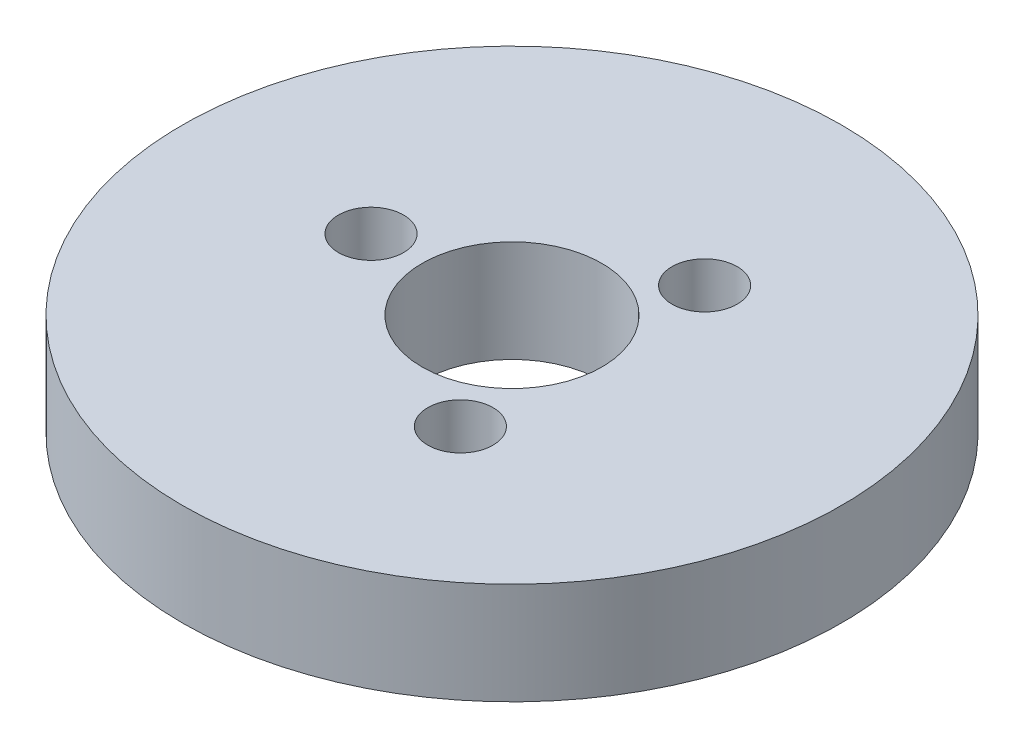
ISO-10303-21;
HEADER;
FILE_DESCRIPTION(('STEP AP214'),'2;1');
FILE_NAME('part.step','',(''),(''),'','','');
FILE_SCHEMA(('AUTOMOTIVE_DESIGN { 1 0 10303 214 1 1 1 1 }'));
ENDSEC;
DATA;
#1=APPLICATION_CONTEXT('core data for automotive mechanical design processes');
#2=APPLICATION_PROTOCOL_DEFINITION('international standard','automotive_design',2000,#1);
#3=PRODUCT_CONTEXT('',#1,'mechanical');
#4=PRODUCT('Part','Part','',(#3));
#5=PRODUCT_RELATED_PRODUCT_CATEGORY('part','',(#4));
#6=PRODUCT_DEFINITION_FORMATION('','',#4);
#7=PRODUCT_DEFINITION_CONTEXT('part definition',#1,'design');
#8=PRODUCT_DEFINITION('design','',#6,#7);
#9=PRODUCT_DEFINITION_SHAPE('','',#8);
#10=(LENGTH_UNIT() NAMED_UNIT(*) SI_UNIT(.MILLI.,.METRE.));
#11=(NAMED_UNIT(*) PLANE_ANGLE_UNIT() SI_UNIT($,.RADIAN.));
#12=(NAMED_UNIT(*) SI_UNIT($,.STERADIAN.) SOLID_ANGLE_UNIT());
#13=UNCERTAINTY_MEASURE_WITH_UNIT(LENGTH_MEASURE(1.E-05),#10,'distance_accuracy_value','');
#14=(GEOMETRIC_REPRESENTATION_CONTEXT(3) GLOBAL_UNCERTAINTY_ASSIGNED_CONTEXT((#13)) GLOBAL_UNIT_ASSIGNED_CONTEXT((#10,
#11,#12)) REPRESENTATION_CONTEXT('',''));
#15=CARTESIAN_POINT('',(0.,0.,0.));
#16=DIRECTION('',(0.,0.,1.));
#17=DIRECTION('',(1.,0.,0.));
#18=AXIS2_PLACEMENT_3D('',#15,#16,#17);
#19=CARTESIAN_POINT('',(0.,17.,0.));
#20=DIRECTION('',(0.,-1.,0.));
#21=DIRECTION('',(0.,0.,-1.));
#22=AXIS2_PLACEMENT_3D('',#19,#20,#21);
#23=CYLINDRICAL_SURFACE('',#22,55.);
#24=CARTESIAN_POINT('',(0.,17.,0.));
#25=DIRECTION('',(0.,1.,0.));
#26=DIRECTION('',(0.,0.,1.));
#27=AXIS2_PLACEMENT_3D('',#24,#25,#26);
#28=CIRCLE('',#27,55.);
#29=CARTESIAN_POINT('',(0.,17.,55.));
#30=VERTEX_POINT('',#29);
#31=EDGE_CURVE('E10',#30,#30,#28,.T.);
#32=ORIENTED_EDGE('',*,*,#31,.F.);
#33=EDGE_LOOP('',(#32));
#34=FACE_BOUND('',#33,.T.);
#35=CARTESIAN_POINT('',(0.,0.,0.));
#36=DIRECTION('',(0.,1.,0.));
#37=DIRECTION('',(0.,0.,1.));
#38=AXIS2_PLACEMENT_3D('',#35,#36,#37);
#39=CIRCLE('',#38,55.);
#40=CARTESIAN_POINT('',(0.,0.,55.));
#41=VERTEX_POINT('',#40);
#42=EDGE_CURVE('E37',#41,#41,#39,.T.);
#43=ORIENTED_EDGE('',*,*,#42,.T.);
#44=EDGE_LOOP('',(#43));
#45=FACE_BOUND('',#44,.T.);
#46=ADVANCED_FACE('F40',(#34,#45),#23,.T.);
#47=CARTESIAN_POINT('',(0.,17.,0.));
#48=DIRECTION('',(0.,1.,0.));
#49=DIRECTION('',(0.,0.,1.));
#50=AXIS2_PLACEMENT_3D('',#47,#48,#49);
#51=PLANE('',#50);
#52=CARTESIAN_POINT('',(11.7658068317736,17.,20.3789752246726));
#53=DIRECTION('',(0.,1.,0.));
#54=DIRECTION('',(0.866025403784436,0.,-0.500000000000004));
#55=AXIS2_PLACEMENT_3D('',#52,#53,#54);
#56=CIRCLE('',#55,5.44015816130691);
#57=CARTESIAN_POINT('',(11.7658068317736,17.,25.8191333859795));
#58=VERTEX_POINT('',#57);
#59=EDGE_CURVE('E70',#58,#58,#56,.T.);
#60=ORIENTED_EDGE('',*,*,#59,.F.);
#61=EDGE_LOOP('',(#60));
#62=FACE_BOUND('',#61,.T.);
#63=CARTESIAN_POINT('',(11.7658068317733,17.,-20.3789752246728));
#64=DIRECTION('',(0.,1.,0.));
#65=DIRECTION('',(-0.866025403784443,0.,-0.499999999999992));
#66=AXIS2_PLACEMENT_3D('',#63,#64,#65);
#67=CIRCLE('',#66,5.44015816130691);
#68=CARTESIAN_POINT('',(11.7658068317733,17.,-14.9388170633658));
#69=VERTEX_POINT('',#68);
#70=EDGE_CURVE('E61',#69,#69,#67,.T.);
#71=ORIENTED_EDGE('',*,*,#70,.F.);
#72=EDGE_LOOP('',(#71));
#73=FACE_BOUND('',#72,.T.);
#74=CARTESIAN_POINT('',(-23.5316136635469,17.,0.));
#75=DIRECTION('',(0.,1.,0.));
#76=DIRECTION('',(0.,0.,1.));
#77=AXIS2_PLACEMENT_3D('',#74,#75,#76);
#78=CIRCLE('',#77,5.44015816130691);
#79=CARTESIAN_POINT('',(-23.5316136635469,17.,5.44015816130691));
#80=VERTEX_POINT('',#79);
#81=EDGE_CURVE('E54',#80,#80,#78,.T.);
#82=ORIENTED_EDGE('',*,*,#81,.F.);
#83=EDGE_LOOP('',(#82));
#84=FACE_BOUND('',#83,.T.);
#85=CARTESIAN_POINT('',(0.,17.,0.));
#86=DIRECTION('',(0.,1.,0.));
#87=DIRECTION('',(0.,0.,1.));
#88=AXIS2_PLACEMENT_3D('',#85,#86,#87);
#89=CIRCLE('',#88,15.);
#90=CARTESIAN_POINT('',(0.,17.,15.));
#91=VERTEX_POINT('',#90);
#92=EDGE_CURVE('E50',#91,#91,#89,.T.);
#93=ORIENTED_EDGE('',*,*,#92,.F.);
#94=EDGE_LOOP('',(#93));
#95=FACE_BOUND('',#94,.T.);
#96=ORIENTED_EDGE('',*,*,#31,.T.);
#97=EDGE_LOOP('',(#96));
#98=FACE_BOUND('',#97,.T.);
#99=ADVANCED_FACE('F85',(#62,#73,#84,#95,#98),#51,.T.);
#100=CARTESIAN_POINT('',(0.,0.,0.));
#101=DIRECTION('',(0.,1.,0.));
#102=DIRECTION('',(0.,0.,1.));
#103=AXIS2_PLACEMENT_3D('',#100,#101,#102);
#104=PLANE('',#103);
#105=CARTESIAN_POINT('',(0.,0.,0.));
#106=DIRECTION('',(0.,1.,0.));
#107=DIRECTION('',(0.,0.,1.));
#108=AXIS2_PLACEMENT_3D('',#105,#106,#107);
#109=CIRCLE('',#108,15.);
#110=CARTESIAN_POINT('',(0.,0.,15.));
#111=VERTEX_POINT('',#110);
#112=EDGE_CURVE('E47',#111,#111,#109,.T.);
#113=ORIENTED_EDGE('',*,*,#112,.T.);
#114=EDGE_LOOP('',(#113));
#115=FACE_BOUND('',#114,.T.);
#116=ORIENTED_EDGE('',*,*,#42,.F.);
#117=EDGE_LOOP('',(#116));
#118=FACE_BOUND('',#117,.T.);
#119=ADVANCED_FACE('F84',(#115,#118),#104,.F.);
#120=CARTESIAN_POINT('',(0.,17.,0.));
#121=DIRECTION('',(0.,-1.,0.));
#122=DIRECTION('',(0.,0.,-1.));
#123=AXIS2_PLACEMENT_3D('',#120,#121,#122);
#124=CYLINDRICAL_SURFACE('',#123,15.);
#125=ORIENTED_EDGE('',*,*,#92,.T.);
#126=EDGE_LOOP('',(#125));
#127=FACE_BOUND('',#126,.T.);
#128=ORIENTED_EDGE('',*,*,#112,.F.);
#129=EDGE_LOOP('',(#128));
#130=FACE_BOUND('',#129,.T.);
#131=ADVANCED_FACE('F91',(#127,#130),#124,.F.);
#132=CARTESIAN_POINT('',(-23.5316136635469,3.84224336417343,0.));
#133=DIRECTION('',(0.,1.,0.));
#134=DIRECTION('',(0.,0.,1.));
#135=AXIS2_PLACEMENT_3D('',#132,#133,#134);
#136=CYLINDRICAL_SURFACE('',#135,5.44015816130691);
#137=CARTESIAN_POINT('',(-23.5316136635469,3.84224336417343,0.));
#138=DIRECTION('',(0.,1.,0.));
#139=DIRECTION('',(0.,0.,1.));
#140=AXIS2_PLACEMENT_3D('',#137,#138,#139);
#141=CIRCLE('',#140,5.44015816130691);
#142=CARTESIAN_POINT('',(-23.5316136635469,3.84224336417343,5.44015816130691));
#143=VERTEX_POINT('',#142);
#144=EDGE_CURVE('E55',#143,#143,#141,.T.);
#145=CARTESIAN_POINT('',(-23.5316136635469,3.84224336417343,5.44015816130691));
#146=CARTESIAN_POINT('',(-23.5316136635469,3.97930332912995,5.44015816130691));
#147=CARTESIAN_POINT('',(-23.5316136635469,4.11636329408648,5.44015816130691));
#148=CARTESIAN_POINT('',(-23.5316136635469,4.39048322399953,5.44015816130691));
#149=CARTESIAN_POINT('',(-23.5316136635469,4.52754318895606,5.44015816130691));
#150=CARTESIAN_POINT('',(-23.5316136635469,4.80166311886911,5.44015816130691));
#151=CARTESIAN_POINT('',(-23.5316136635469,4.93872308382564,5.44015816130691));
#152=CARTESIAN_POINT('',(-23.5316136635469,5.21284301373869,5.44015816130691));
#153=CARTESIAN_POINT('',(-23.5316136635469,5.34990297869522,5.44015816130691));
#154=CARTESIAN_POINT('',(-23.5316136635469,5.62402290860827,5.44015816130691));
#155=CARTESIAN_POINT('',(-23.5316136635469,5.7610828735648,5.44015816130691));
#156=CARTESIAN_POINT('',(-23.5316136635469,6.03520280347785,5.44015816130691));
#157=CARTESIAN_POINT('',(-23.5316136635469,6.17226276843438,5.44015816130691));
#158=CARTESIAN_POINT('',(-23.5316136635469,6.44638269834743,5.44015816130691));
#159=CARTESIAN_POINT('',(-23.5316136635469,6.58344266330396,5.44015816130691));
#160=CARTESIAN_POINT('',(-23.5316136635469,6.85756259321702,5.44015816130691));
#161=CARTESIAN_POINT('',(-23.5316136635469,6.99462255817354,5.44015816130691));
#162=CARTESIAN_POINT('',(-23.5316136635469,7.2687424880866,5.44015816130691));
#163=CARTESIAN_POINT('',(-23.5316136635469,7.40580245304312,5.44015816130691));
#164=CARTESIAN_POINT('',(-23.5316136635469,7.67992238295618,5.44015816130691));
#165=CARTESIAN_POINT('',(-23.5316136635469,7.8169823479127,5.44015816130691));
#166=CARTESIAN_POINT('',(-23.5316136635469,8.09110227782576,5.44015816130691));
#167=CARTESIAN_POINT('',(-23.5316136635469,8.22816224278228,5.44015816130691));
#168=CARTESIAN_POINT('',(-23.5316136635469,8.50228217269534,5.44015816130691));
#169=CARTESIAN_POINT('',(-23.5316136635469,8.63934213765186,5.44015816130691));
#170=CARTESIAN_POINT('',(-23.5316136635469,8.91346206756492,5.44015816130691));
#171=CARTESIAN_POINT('',(-23.5316136635469,9.05052203252144,5.44015816130691));
#172=CARTESIAN_POINT('',(-23.5316136635469,9.3246419624345,5.44015816130691));
#173=CARTESIAN_POINT('',(-23.5316136635469,9.46170192739102,5.44015816130691));
#174=CARTESIAN_POINT('',(-23.5316136635469,9.73582185730408,5.44015816130691));
#175=CARTESIAN_POINT('',(-23.5316136635469,9.87288182226061,5.44015816130691));
#176=CARTESIAN_POINT('',(-23.5316136635469,10.1470017521737,5.44015816130691));
#177=CARTESIAN_POINT('',(-23.5316136635469,10.2840617171302,5.44015816130691));
#178=CARTESIAN_POINT('',(-23.5316136635469,10.5581816470432,5.44015816130691));
#179=CARTESIAN_POINT('',(-23.5316136635469,10.6952416119998,5.44015816130691));
#180=CARTESIAN_POINT('',(-23.5316136635469,10.9693615419128,5.44015816130691));
#181=CARTESIAN_POINT('',(-23.5316136635469,11.1064215068693,5.44015816130691));
#182=CARTESIAN_POINT('',(-23.5316136635469,11.3805414367824,5.44015816130691));
#183=CARTESIAN_POINT('',(-23.5316136635469,11.5176014017389,5.44015816130691));
#184=CARTESIAN_POINT('',(-23.5316136635469,11.791721331652,5.44015816130691));
#185=CARTESIAN_POINT('',(-23.5316136635469,11.9287812966085,5.44015816130691));
#186=CARTESIAN_POINT('',(-23.5316136635469,12.2029012265216,5.44015816130691));
#187=CARTESIAN_POINT('',(-23.5316136635469,12.3399611914781,5.44015816130691));
#188=CARTESIAN_POINT('',(-23.5316136635469,12.6140811213911,5.44015816130691));
#189=CARTESIAN_POINT('',(-23.5316136635469,12.7511410863477,5.44015816130691));
#190=CARTESIAN_POINT('',(-23.5316136635469,13.0252610162607,5.44015816130691));
#191=CARTESIAN_POINT('',(-23.5316136635469,13.1623209812172,5.44015816130691));
#192=CARTESIAN_POINT('',(-23.5316136635469,13.4364409111303,5.44015816130691));
#193=CARTESIAN_POINT('',(-23.5316136635469,13.5735008760868,5.44015816130691));
#194=CARTESIAN_POINT('',(-23.5316136635469,13.8476208059999,5.44015816130691));
#195=CARTESIAN_POINT('',(-23.5316136635469,13.9846807709564,5.44015816130691));
#196=CARTESIAN_POINT('',(-23.5316136635469,14.2588007008695,5.44015816130691));
#197=CARTESIAN_POINT('',(-23.5316136635469,14.395860665826,5.44015816130691));
#198=CARTESIAN_POINT('',(-23.5316136635469,14.669980595739,5.44015816130691));
#199=CARTESIAN_POINT('',(-23.5316136635469,14.8070405606956,5.44015816130691));
#200=CARTESIAN_POINT('',(-23.5316136635469,15.0811604906086,5.44015816130691));
#201=CARTESIAN_POINT('',(-23.5316136635469,15.2182204555652,5.44015816130691));
#202=CARTESIAN_POINT('',(-23.5316136635469,15.4923403854782,5.44015816130691));
#203=CARTESIAN_POINT('',(-23.5316136635469,15.6294003504347,5.44015816130691));
#204=CARTESIAN_POINT('',(-23.5316136635469,15.9035202803478,5.44015816130691));
#205=CARTESIAN_POINT('',(-23.5316136635469,16.0405802453043,5.44015816130691));
#206=CARTESIAN_POINT('',(-23.5316136635469,16.3147001752174,5.44015816130691));
#207=CARTESIAN_POINT('',(-23.5316136635469,16.4517601401739,5.44015816130691));
#208=CARTESIAN_POINT('',(-23.5316136635469,16.7258800700869,5.44015816130691));
#209=CARTESIAN_POINT('',(-23.5316136635469,16.8629400350435,5.44015816130691));
#210=CARTESIAN_POINT('',(-23.5316136635469,17.,5.44015816130691));
#211=B_SPLINE_CURVE_WITH_KNOTS('',3,(#145,#146,#147,#148,#149,#150,#151,#152,#153,#154,#155,
#156,#157,#158,#159,#160,#161,#162,#163,#164,#165,#166,#167,#168,#169,#170,#171,#172,#173,#174,
#175,#176,#177,#178,#179,#180,#181,#182,#183,#184,#185,#186,#187,#188,#189,#190,#191,#192,#193,
#194,#195,#196,#197,#198,#199,#200,#201,#202,#203,#204,#205,#206,#207,#208,#209,#210),
.UNSPECIFIED.,.F.,.F.,(4,2,2,2,2,2,2,2,2,2,2,2,2,2,2,2,2,2,2,2,2,2,2,2,2,2,2,2,2,2,2,2,4),(0.,
0.411179894869581,0.822359789739161,1.23353968460874,1.64471957947832,2.0558994743479,
2.46707936921748,2.87825926408706,3.28943915895664,3.70061905382622,4.1117989486958,
4.52297884356538,4.93415873843496,5.34533863330455,5.75651852817412,6.16769842304371,
6.57887831791329,6.99005821278287,7.40123810765245,7.81241800252203,8.22359789739161,
8.63477779226119,9.04595768713077,9.45713758200035,9.86831747686993,10.2794973717395,
10.6906772666091,11.1018571614787,11.5130370563483,11.9242169512178,12.3353968460874,
12.746576740957,13.1577566358266),.UNSPECIFIED.);
#212=EDGE_CURVE('BSEAM96',#143,#80,#211,.T.);
#213=ORIENTED_EDGE('',*,*,#144,.F.);
#214=ORIENTED_EDGE('',*,*,#81,.T.);
#215=ORIENTED_EDGE('',*,*,#212,.T.);
#216=ORIENTED_EDGE('',*,*,#212,.F.);
#217=EDGE_LOOP('',(#213,#215,#214,#216));
#218=FACE_BOUND('',#217,.T.);
#219=ADVANCED_FACE('F96',(#218),#136,.F.);
#220=CARTESIAN_POINT('',(-23.5316136635469,3.84224336417343,0.));
#221=DIRECTION('',(0.,1.,0.));
#222=DIRECTION('',(0.,0.,1.));
#223=AXIS2_PLACEMENT_3D('',#220,#221,#222);
#224=PLANE('',#223);
#225=ORIENTED_EDGE('',*,*,#144,.T.);
#226=EDGE_LOOP('',(#225));
#227=FACE_BOUND('',#226,.T.);
#228=ADVANCED_FACE('F127',(#227),#224,.T.);
#229=CARTESIAN_POINT('',(11.7658068317733,3.84224336417343,-20.3789752246728));
#230=DIRECTION('',(0.,1.,0.));
#231=DIRECTION('',(0.,0.,1.));
#232=AXIS2_PLACEMENT_3D('',#229,#230,#231);
#233=CYLINDRICAL_SURFACE('',#232,5.44015816130691);
#234=CARTESIAN_POINT('',(11.7658068317733,3.84224336417343,-20.3789752246728));
#235=DIRECTION('',(0.,1.,0.));
#236=DIRECTION('',(-0.866025403784443,0.,-0.499999999999992));
#237=AXIS2_PLACEMENT_3D('',#234,#235,#236);
#238=CIRCLE('',#237,5.44015816130691);
#239=CARTESIAN_POINT('',(11.7658068317733,3.84224336417343,-14.9388170633658));
#240=VERTEX_POINT('',#239);
#241=EDGE_CURVE('E63',#240,#240,#238,.T.);
#242=CARTESIAN_POINT('',(11.7658068317733,3.84224336417343,-14.9388170633658));
#243=CARTESIAN_POINT('',(11.7658068317733,3.97930332912995,-14.9388170633658));
#244=CARTESIAN_POINT('',(11.7658068317733,4.11636329408648,-14.9388170633658));
#245=CARTESIAN_POINT('',(11.7658068317733,4.39048322399953,-14.9388170633658));
#246=CARTESIAN_POINT('',(11.7658068317733,4.52754318895606,-14.9388170633658));
#247=CARTESIAN_POINT('',(11.7658068317733,4.80166311886911,-14.9388170633658));
#248=CARTESIAN_POINT('',(11.7658068317733,4.93872308382564,-14.9388170633658));
#249=CARTESIAN_POINT('',(11.7658068317733,5.21284301373869,-14.9388170633658));
#250=CARTESIAN_POINT('',(11.7658068317733,5.34990297869522,-14.9388170633658));
#251=CARTESIAN_POINT('',(11.7658068317733,5.62402290860827,-14.9388170633658));
#252=CARTESIAN_POINT('',(11.7658068317733,5.7610828735648,-14.9388170633658));
#253=CARTESIAN_POINT('',(11.7658068317733,6.03520280347785,-14.9388170633658));
#254=CARTESIAN_POINT('',(11.7658068317733,6.17226276843438,-14.9388170633658));
#255=CARTESIAN_POINT('',(11.7658068317733,6.44638269834743,-14.9388170633658));
#256=CARTESIAN_POINT('',(11.7658068317733,6.58344266330396,-14.9388170633658));
#257=CARTESIAN_POINT('',(11.7658068317733,6.85756259321702,-14.9388170633658));
#258=CARTESIAN_POINT('',(11.7658068317733,6.99462255817354,-14.9388170633658));
#259=CARTESIAN_POINT('',(11.7658068317733,7.2687424880866,-14.9388170633658));
#260=CARTESIAN_POINT('',(11.7658068317733,7.40580245304312,-14.9388170633658));
#261=CARTESIAN_POINT('',(11.7658068317733,7.67992238295618,-14.9388170633658));
#262=CARTESIAN_POINT('',(11.7658068317733,7.8169823479127,-14.9388170633658));
#263=CARTESIAN_POINT('',(11.7658068317733,8.09110227782576,-14.9388170633658));
#264=CARTESIAN_POINT('',(11.7658068317733,8.22816224278228,-14.9388170633658));
#265=CARTESIAN_POINT('',(11.7658068317733,8.50228217269534,-14.9388170633658));
#266=CARTESIAN_POINT('',(11.7658068317733,8.63934213765186,-14.9388170633658));
#267=CARTESIAN_POINT('',(11.7658068317733,8.91346206756492,-14.9388170633658));
#268=CARTESIAN_POINT('',(11.7658068317733,9.05052203252144,-14.9388170633658));
#269=CARTESIAN_POINT('',(11.7658068317733,9.3246419624345,-14.9388170633658));
#270=CARTESIAN_POINT('',(11.7658068317733,9.46170192739102,-14.9388170633658));
#271=CARTESIAN_POINT('',(11.7658068317733,9.73582185730408,-14.9388170633658));
#272=CARTESIAN_POINT('',(11.7658068317733,9.87288182226061,-14.9388170633658));
#273=CARTESIAN_POINT('',(11.7658068317733,10.1470017521737,-14.9388170633658));
#274=CARTESIAN_POINT('',(11.7658068317733,10.2840617171302,-14.9388170633658));
#275=CARTESIAN_POINT('',(11.7658068317733,10.5581816470432,-14.9388170633658));
#276=CARTESIAN_POINT('',(11.7658068317733,10.6952416119998,-14.9388170633658));
#277=CARTESIAN_POINT('',(11.7658068317733,10.9693615419128,-14.9388170633658));
#278=CARTESIAN_POINT('',(11.7658068317733,11.1064215068693,-14.9388170633658));
#279=CARTESIAN_POINT('',(11.7658068317733,11.3805414367824,-14.9388170633658));
#280=CARTESIAN_POINT('',(11.7658068317733,11.5176014017389,-14.9388170633658));
#281=CARTESIAN_POINT('',(11.7658068317733,11.791721331652,-14.9388170633658));
#282=CARTESIAN_POINT('',(11.7658068317733,11.9287812966085,-14.9388170633658));
#283=CARTESIAN_POINT('',(11.7658068317733,12.2029012265216,-14.9388170633658));
#284=CARTESIAN_POINT('',(11.7658068317733,12.3399611914781,-14.9388170633658));
#285=CARTESIAN_POINT('',(11.7658068317733,12.6140811213911,-14.9388170633658));
#286=CARTESIAN_POINT('',(11.7658068317733,12.7511410863477,-14.9388170633658));
#287=CARTESIAN_POINT('',(11.7658068317733,13.0252610162607,-14.9388170633658));
#288=CARTESIAN_POINT('',(11.7658068317733,13.1623209812172,-14.9388170633658));
#289=CARTESIAN_POINT('',(11.7658068317733,13.4364409111303,-14.9388170633658));
#290=CARTESIAN_POINT('',(11.7658068317733,13.5735008760868,-14.9388170633658));
#291=CARTESIAN_POINT('',(11.7658068317733,13.8476208059999,-14.9388170633658));
#292=CARTESIAN_POINT('',(11.7658068317733,13.9846807709564,-14.9388170633658));
#293=CARTESIAN_POINT('',(11.7658068317733,14.2588007008695,-14.9388170633658));
#294=CARTESIAN_POINT('',(11.7658068317733,14.395860665826,-14.9388170633658));
#295=CARTESIAN_POINT('',(11.7658068317733,14.669980595739,-14.9388170633658));
#296=CARTESIAN_POINT('',(11.7658068317733,14.8070405606956,-14.9388170633658));
#297=CARTESIAN_POINT('',(11.7658068317733,15.0811604906086,-14.9388170633658));
#298=CARTESIAN_POINT('',(11.7658068317733,15.2182204555652,-14.9388170633658));
#299=CARTESIAN_POINT('',(11.7658068317733,15.4923403854782,-14.9388170633658));
#300=CARTESIAN_POINT('',(11.7658068317733,15.6294003504347,-14.9388170633658));
#301=CARTESIAN_POINT('',(11.7658068317733,15.9035202803478,-14.9388170633658));
#302=CARTESIAN_POINT('',(11.7658068317733,16.0405802453043,-14.9388170633658));
#303=CARTESIAN_POINT('',(11.7658068317733,16.3147001752174,-14.9388170633658));
#304=CARTESIAN_POINT('',(11.7658068317733,16.4517601401739,-14.9388170633658));
#305=CARTESIAN_POINT('',(11.7658068317733,16.7258800700869,-14.9388170633658));
#306=CARTESIAN_POINT('',(11.7658068317733,16.8629400350435,-14.9388170633658));
#307=CARTESIAN_POINT('',(11.7658068317733,17.,-14.9388170633658));
#308=B_SPLINE_CURVE_WITH_KNOTS('',3,(#242,#243,#244,#245,#246,#247,#248,#249,#250,#251,#252,
#253,#254,#255,#256,#257,#258,#259,#260,#261,#262,#263,#264,#265,#266,#267,#268,#269,#270,#271,
#272,#273,#274,#275,#276,#277,#278,#279,#280,#281,#282,#283,#284,#285,#286,#287,#288,#289,#290,
#291,#292,#293,#294,#295,#296,#297,#298,#299,#300,#301,#302,#303,#304,#305,#306,#307),
.UNSPECIFIED.,.F.,.F.,(4,2,2,2,2,2,2,2,2,2,2,2,2,2,2,2,2,2,2,2,2,2,2,2,2,2,2,2,2,2,2,2,4),(0.,
0.411179894869581,0.822359789739161,1.23353968460874,1.64471957947832,2.0558994743479,
2.46707936921748,2.87825926408706,3.28943915895664,3.70061905382622,4.1117989486958,
4.52297884356538,4.93415873843496,5.34533863330455,5.75651852817412,6.16769842304371,
6.57887831791329,6.99005821278287,7.40123810765245,7.81241800252203,8.22359789739161,
8.63477779226119,9.04595768713077,9.45713758200035,9.86831747686993,10.2794973717395,
10.6906772666091,11.1018571614787,11.5130370563483,11.9242169512178,12.3353968460874,
12.746576740957,13.1577566358266),.UNSPECIFIED.);
#309=EDGE_CURVE('BSEAM133',#240,#69,#308,.T.);
#310=ORIENTED_EDGE('',*,*,#241,.F.);
#311=ORIENTED_EDGE('',*,*,#70,.T.);
#312=ORIENTED_EDGE('',*,*,#309,.T.);
#313=ORIENTED_EDGE('',*,*,#309,.F.);
#314=EDGE_LOOP('',(#310,#312,#311,#313));
#315=FACE_BOUND('',#314,.T.);
#316=ADVANCED_FACE('F133',(#315),#233,.F.);
#317=CARTESIAN_POINT('',(11.7658068317733,3.84224336417343,-20.3789752246728));
#318=DIRECTION('',(0.,1.,0.));
#319=DIRECTION('',(-0.866025403784443,0.,-0.499999999999992));
#320=AXIS2_PLACEMENT_3D('',#317,#318,#319);
#321=PLANE('',#320);
#322=ORIENTED_EDGE('',*,*,#241,.T.);
#323=EDGE_LOOP('',(#322));
#324=FACE_BOUND('',#323,.T.);
#325=ADVANCED_FACE('F77',(#324),#321,.T.);
#326=CARTESIAN_POINT('',(11.7658068317736,3.84224336417343,20.3789752246726));
#327=DIRECTION('',(0.,1.,0.));
#328=DIRECTION('',(0.,0.,1.));
#329=AXIS2_PLACEMENT_3D('',#326,#327,#328);
#330=CYLINDRICAL_SURFACE('',#329,5.44015816130691);
#331=CARTESIAN_POINT('',(11.7658068317736,3.84224336417343,20.3789752246726));
#332=DIRECTION('',(0.,1.,0.));
#333=DIRECTION('',(0.866025403784436,0.,-0.500000000000004));
#334=AXIS2_PLACEMENT_3D('',#331,#332,#333);
#335=CIRCLE('',#334,5.44015816130691);
#336=CARTESIAN_POINT('',(11.7658068317736,3.84224336417343,25.8191333859795));
#337=VERTEX_POINT('',#336);
#338=EDGE_CURVE('E59',#337,#337,#335,.T.);
#339=CARTESIAN_POINT('',(11.7658068317736,3.84224336417343,25.8191333859795));
#340=CARTESIAN_POINT('',(11.7658068317736,3.97930332912995,25.8191333859795));
#341=CARTESIAN_POINT('',(11.7658068317736,4.11636329408648,25.8191333859795));
#342=CARTESIAN_POINT('',(11.7658068317736,4.39048322399953,25.8191333859795));
#343=CARTESIAN_POINT('',(11.7658068317736,4.52754318895606,25.8191333859795));
#344=CARTESIAN_POINT('',(11.7658068317736,4.80166311886911,25.8191333859795));
#345=CARTESIAN_POINT('',(11.7658068317736,4.93872308382564,25.8191333859795));
#346=CARTESIAN_POINT('',(11.7658068317736,5.21284301373869,25.8191333859795));
#347=CARTESIAN_POINT('',(11.7658068317736,5.34990297869522,25.8191333859795));
#348=CARTESIAN_POINT('',(11.7658068317736,5.62402290860827,25.8191333859795));
#349=CARTESIAN_POINT('',(11.7658068317736,5.7610828735648,25.8191333859795));
#350=CARTESIAN_POINT('',(11.7658068317736,6.03520280347785,25.8191333859795));
#351=CARTESIAN_POINT('',(11.7658068317736,6.17226276843438,25.8191333859795));
#352=CARTESIAN_POINT('',(11.7658068317736,6.44638269834743,25.8191333859795));
#353=CARTESIAN_POINT('',(11.7658068317736,6.58344266330396,25.8191333859795));
#354=CARTESIAN_POINT('',(11.7658068317736,6.85756259321702,25.8191333859795));
#355=CARTESIAN_POINT('',(11.7658068317736,6.99462255817354,25.8191333859795));
#356=CARTESIAN_POINT('',(11.7658068317736,7.2687424880866,25.8191333859795));
#357=CARTESIAN_POINT('',(11.7658068317736,7.40580245304312,25.8191333859795));
#358=CARTESIAN_POINT('',(11.7658068317736,7.67992238295618,25.8191333859795));
#359=CARTESIAN_POINT('',(11.7658068317736,7.8169823479127,25.8191333859795));
#360=CARTESIAN_POINT('',(11.7658068317736,8.09110227782576,25.8191333859795));
#361=CARTESIAN_POINT('',(11.7658068317736,8.22816224278228,25.8191333859795));
#362=CARTESIAN_POINT('',(11.7658068317736,8.50228217269534,25.8191333859795));
#363=CARTESIAN_POINT('',(11.7658068317736,8.63934213765186,25.8191333859795));
#364=CARTESIAN_POINT('',(11.7658068317736,8.91346206756492,25.8191333859795));
#365=CARTESIAN_POINT('',(11.7658068317736,9.05052203252144,25.8191333859795));
#366=CARTESIAN_POINT('',(11.7658068317736,9.3246419624345,25.8191333859795));
#367=CARTESIAN_POINT('',(11.7658068317736,9.46170192739102,25.8191333859795));
#368=CARTESIAN_POINT('',(11.7658068317736,9.73582185730408,25.8191333859795));
#369=CARTESIAN_POINT('',(11.7658068317736,9.87288182226061,25.8191333859795));
#370=CARTESIAN_POINT('',(11.7658068317736,10.1470017521737,25.8191333859795));
#371=CARTESIAN_POINT('',(11.7658068317736,10.2840617171302,25.8191333859795));
#372=CARTESIAN_POINT('',(11.7658068317736,10.5581816470432,25.8191333859795));
#373=CARTESIAN_POINT('',(11.7658068317736,10.6952416119998,25.8191333859795));
#374=CARTESIAN_POINT('',(11.7658068317736,10.9693615419128,25.8191333859795));
#375=CARTESIAN_POINT('',(11.7658068317736,11.1064215068693,25.8191333859795));
#376=CARTESIAN_POINT('',(11.7658068317736,11.3805414367824,25.8191333859795));
#377=CARTESIAN_POINT('',(11.7658068317736,11.5176014017389,25.8191333859795));
#378=CARTESIAN_POINT('',(11.7658068317736,11.791721331652,25.8191333859795));
#379=CARTESIAN_POINT('',(11.7658068317736,11.9287812966085,25.8191333859795));
#380=CARTESIAN_POINT('',(11.7658068317736,12.2029012265216,25.8191333859795));
#381=CARTESIAN_POINT('',(11.7658068317736,12.3399611914781,25.8191333859795));
#382=CARTESIAN_POINT('',(11.7658068317736,12.6140811213911,25.8191333859795));
#383=CARTESIAN_POINT('',(11.7658068317736,12.7511410863477,25.8191333859795));
#384=CARTESIAN_POINT('',(11.7658068317736,13.0252610162607,25.8191333859795));
#385=CARTESIAN_POINT('',(11.7658068317736,13.1623209812172,25.8191333859795));
#386=CARTESIAN_POINT('',(11.7658068317736,13.4364409111303,25.8191333859795));
#387=CARTESIAN_POINT('',(11.7658068317736,13.5735008760868,25.8191333859795));
#388=CARTESIAN_POINT('',(11.7658068317736,13.8476208059999,25.8191333859795));
#389=CARTESIAN_POINT('',(11.7658068317736,13.9846807709564,25.8191333859795));
#390=CARTESIAN_POINT('',(11.7658068317736,14.2588007008695,25.8191333859795));
#391=CARTESIAN_POINT('',(11.7658068317736,14.395860665826,25.8191333859795));
#392=CARTESIAN_POINT('',(11.7658068317736,14.669980595739,25.8191333859795));
#393=CARTESIAN_POINT('',(11.7658068317736,14.8070405606956,25.8191333859795));
#394=CARTESIAN_POINT('',(11.7658068317736,15.0811604906086,25.8191333859795));
#395=CARTESIAN_POINT('',(11.7658068317736,15.2182204555652,25.8191333859795));
#396=CARTESIAN_POINT('',(11.7658068317736,15.4923403854782,25.8191333859795));
#397=CARTESIAN_POINT('',(11.7658068317736,15.6294003504347,25.8191333859795));
#398=CARTESIAN_POINT('',(11.7658068317736,15.9035202803478,25.8191333859795));
#399=CARTESIAN_POINT('',(11.7658068317736,16.0405802453043,25.8191333859795));
#400=CARTESIAN_POINT('',(11.7658068317736,16.3147001752174,25.8191333859795));
#401=CARTESIAN_POINT('',(11.7658068317736,16.4517601401739,25.8191333859795));
#402=CARTESIAN_POINT('',(11.7658068317736,16.7258800700869,25.8191333859795));
#403=CARTESIAN_POINT('',(11.7658068317736,16.8629400350435,25.8191333859795));
#404=CARTESIAN_POINT('',(11.7658068317736,17.,25.8191333859795));
#405=B_SPLINE_CURVE_WITH_KNOTS('',3,(#339,#340,#341,#342,#343,#344,#345,#346,#347,#348,#349,
#350,#351,#352,#353,#354,#355,#356,#357,#358,#359,#360,#361,#362,#363,#364,#365,#366,#367,#368,
#369,#370,#371,#372,#373,#374,#375,#376,#377,#378,#379,#380,#381,#382,#383,#384,#385,#386,#387,
#388,#389,#390,#391,#392,#393,#394,#395,#396,#397,#398,#399,#400,#401,#402,#403,#404),
.UNSPECIFIED.,.F.,.F.,(4,2,2,2,2,2,2,2,2,2,2,2,2,2,2,2,2,2,2,2,2,2,2,2,2,2,2,2,2,2,2,2,4),(0.,
0.411179894869581,0.822359789739161,1.23353968460874,1.64471957947832,2.0558994743479,
2.46707936921748,2.87825926408706,3.28943915895664,3.70061905382622,4.1117989486958,
4.52297884356538,4.93415873843496,5.34533863330455,5.75651852817412,6.16769842304371,
6.57887831791329,6.99005821278287,7.40123810765245,7.81241800252203,8.22359789739161,
8.63477779226119,9.04595768713077,9.45713758200035,9.86831747686993,10.2794973717395,
10.6906772666091,11.1018571614787,11.5130370563483,11.9242169512178,12.3353968460874,
12.746576740957,13.1577566358266),.UNSPECIFIED.);
#406=EDGE_CURVE('BSEAM73',#337,#58,#405,.T.);
#407=ORIENTED_EDGE('',*,*,#338,.F.);
#408=ORIENTED_EDGE('',*,*,#59,.T.);
#409=ORIENTED_EDGE('',*,*,#406,.T.);
#410=ORIENTED_EDGE('',*,*,#406,.F.);
#411=EDGE_LOOP('',(#407,#409,#408,#410));
#412=FACE_BOUND('',#411,.T.);
#413=ADVANCED_FACE('F73',(#412),#330,.F.);
#414=CARTESIAN_POINT('',(11.7658068317736,3.84224336417343,20.3789752246726));
#415=DIRECTION('',(0.,1.,0.));
#416=DIRECTION('',(0.866025403784436,0.,-0.500000000000004));
#417=AXIS2_PLACEMENT_3D('',#414,#415,#416);
#418=PLANE('',#417);
#419=ORIENTED_EDGE('',*,*,#338,.T.);
#420=EDGE_LOOP('',(#419));
#421=FACE_BOUND('',#420,.T.);
#422=ADVANCED_FACE('F71',(#421),#418,.T.);
#423=CLOSED_SHELL('',(#46,#99,#119,#131,#219,#228,#316,#325,#413,#422));
#424=MANIFOLD_SOLID_BREP('B2',#423);
#425=ADVANCED_BREP_SHAPE_REPRESENTATION('',(#18,#424),#14);
#426=SHAPE_DEFINITION_REPRESENTATION(#9,#425);
ENDSEC;
END-ISO-10303-21;
